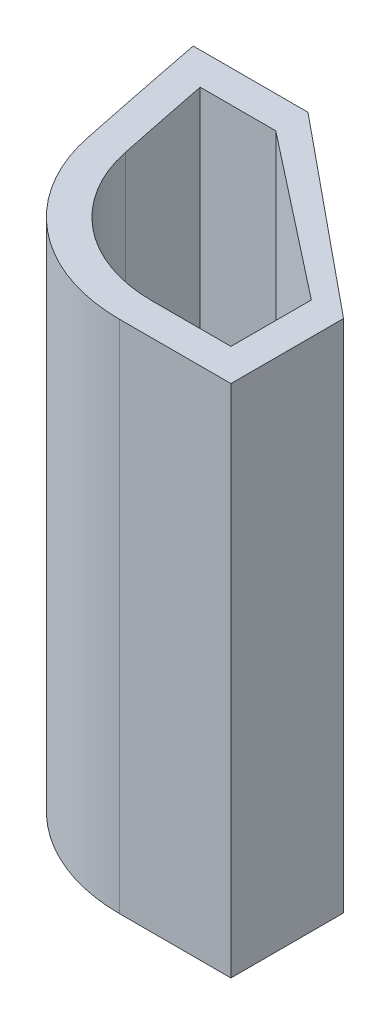
ISO-10303-21;
HEADER;
FILE_DESCRIPTION(('STEP AP214'),'2;1');
FILE_NAME('part.step','',(''),(''),'','','');
FILE_SCHEMA(('AUTOMOTIVE_DESIGN { 1 0 10303 214 1 1 1 1 }'));
ENDSEC;
DATA;
#1=APPLICATION_CONTEXT('core data for automotive mechanical design processes');
#2=APPLICATION_PROTOCOL_DEFINITION('international standard','automotive_design',2000,#1);
#3=PRODUCT_CONTEXT('',#1,'mechanical');
#4=PRODUCT('Part','Part','',(#3));
#5=PRODUCT_RELATED_PRODUCT_CATEGORY('part','',(#4));
#6=PRODUCT_DEFINITION_FORMATION('','',#4);
#7=PRODUCT_DEFINITION_CONTEXT('part definition',#1,'design');
#8=PRODUCT_DEFINITION('design','',#6,#7);
#9=PRODUCT_DEFINITION_SHAPE('','',#8);
#10=(LENGTH_UNIT() NAMED_UNIT(*) SI_UNIT(.MILLI.,.METRE.));
#11=(NAMED_UNIT(*) PLANE_ANGLE_UNIT() SI_UNIT($,.RADIAN.));
#12=(NAMED_UNIT(*) SI_UNIT($,.STERADIAN.) SOLID_ANGLE_UNIT());
#13=UNCERTAINTY_MEASURE_WITH_UNIT(LENGTH_MEASURE(1.E-05),#10,'distance_accuracy_value','');
#14=(GEOMETRIC_REPRESENTATION_CONTEXT(3) GLOBAL_UNCERTAINTY_ASSIGNED_CONTEXT((#13)) GLOBAL_UNIT_ASSIGNED_CONTEXT((#10,
#11,#12)) REPRESENTATION_CONTEXT('',''));
#15=CARTESIAN_POINT('',(0.,0.,0.));
#16=DIRECTION('',(0.,0.,1.));
#17=DIRECTION('',(1.,0.,0.));
#18=AXIS2_PLACEMENT_3D('',#15,#16,#17);
#19=CARTESIAN_POINT('',(0.919071585330417,16.,-1.40997917301637));
#20=DIRECTION('',(0.,1.,0.));
#21=DIRECTION('',(0.,0.,1.));
#22=AXIS2_PLACEMENT_3D('',#19,#20,#21);
#23=PLANE('',#22);
#24=DIRECTION('',(-0.773651844171533,0.,-0.633610940569988));
#25=VECTOR('',#24,1.);
#26=CARTESIAN_POINT('',(-1.72892998548849,16.,-4.40997917301636));
#27=LINE('',#26,#25);
#28=CARTESIAN_POINT('',(4.37617169943164,16.,0.590020826983631));
#29=VERTEX_POINT('',#28);
#30=CARTESIAN_POINT('',(-1.72892998548849,16.,-4.40997917301636));
#31=VERTEX_POINT('',#30);
#32=EDGE_CURVE('E202',#29,#31,#27,.T.);
#33=ORIENTED_EDGE('',*,*,#32,.T.);
#34=DIRECTION('',(-1.,0.,0.));
#35=VECTOR('',#34,1.);
#36=CARTESIAN_POINT('',(-1.72892998548849,16.,-4.40997917301636));
#37=LINE('',#36,#35);
#38=CARTESIAN_POINT('',(-5.29558734170321,16.,-4.40997917301635));
#39=VERTEX_POINT('',#38);
#40=EDGE_CURVE('E206',#31,#39,#37,.T.);
#41=ORIENTED_EDGE('',*,*,#40,.T.);
#42=CARTESIAN_POINT('',(330.516796699431,16.,-69.9099791730164));
#43=DIRECTION('',(0.,1.,0.));
#44=DIRECTION('',(0.,0.,1.));
#45=AXIS2_PLACEMENT_3D('',#42,#43,#44);
#46=CIRCLE('',#45,342.140625);
#47=CARTESIAN_POINT('',(-4.46586223876633,16.,-0.290833199472776));
#48=VERTEX_POINT('',#47);
#49=EDGE_CURVE('E210',#39,#48,#46,.T.);
#50=ORIENTED_EDGE('',*,*,#49,.T.);
#51=CARTESIAN_POINT('',(0.919071585330417,16.,-1.40997917301637));
#52=DIRECTION('',(0.,1.,0.));
#53=DIRECTION('',(0.,0.,1.));
#54=AXIS2_PLACEMENT_3D('',#51,#52,#53);
#55=CIRCLE('',#54,5.50000000000001);
#56=CARTESIAN_POINT('',(0.919071585330416,16.,4.09002082698364));
#57=VERTEX_POINT('',#56);
#58=EDGE_CURVE('E213',#48,#57,#55,.T.);
#59=ORIENTED_EDGE('',*,*,#58,.T.);
#60=DIRECTION('',(1.,0.,0.));
#61=VECTOR('',#60,1.);
#62=CARTESIAN_POINT('',(0.919071585330416,16.,4.09002082698364));
#63=LINE('',#62,#61);
#64=CARTESIAN_POINT('',(4.37617169943164,16.,4.09002082698364));
#65=VERTEX_POINT('',#64);
#66=EDGE_CURVE('E216',#57,#65,#63,.T.);
#67=ORIENTED_EDGE('',*,*,#66,.T.);
#68=DIRECTION('',(0.,0.,-1.));
#69=VECTOR('',#68,1.);
#70=CARTESIAN_POINT('',(4.37617169943164,16.,0.590020826983631));
#71=LINE('',#70,#69);
#72=EDGE_CURVE('E219',#65,#29,#71,.T.);
#73=ORIENTED_EDGE('',*,*,#72,.T.);
#74=EDGE_LOOP('',(#33,#41,#50,#59,#67,#73));
#75=FACE_BOUND('',#74,.T.);
#76=CARTESIAN_POINT('',(330.516796699431,16.,-69.9099791730164));
#77=DIRECTION('',(0.,1.,0.));
#78=DIRECTION('',(0.,0.,1.));
#79=AXIS2_PLACEMENT_3D('',#76,#77,#78);
#80=CIRCLE('',#79,341.140625);
#81=CARTESIAN_POINT('',(-4.07949142312153,16.,-3.40997917301628));
#82=VERTEX_POINT('',#81);
#83=CARTESIAN_POINT('',(-3.48678336165792,16.,-0.494314285571924));
#84=VERTEX_POINT('',#83);
#85=EDGE_CURVE('E140',#82,#84,#80,.T.);
#86=ORIENTED_EDGE('',*,*,#85,.F.);
#87=DIRECTION('',(-1.,0.,0.));
#88=VECTOR('',#87,1.);
#89=CARTESIAN_POINT('',(-1.72892998548849,16.,-3.40997917301636));
#90=LINE('',#89,#88);
#91=CARTESIAN_POINT('',(-1.72892998548849,16.,-3.40997917301636));
#92=VERTEX_POINT('',#91);
#93=EDGE_CURVE('E131',#92,#82,#90,.T.);
#94=ORIENTED_EDGE('',*,*,#93,.F.);
#95=DIRECTION('',(-0.787152920387147,0.,-0.616757877879144));
#96=VECTOR('',#95,1.);
#97=CARTESIAN_POINT('',(-1.72892998548849,16.,-3.40997917301636));
#98=LINE('',#97,#96);
#99=CARTESIAN_POINT('',(3.37617169943164,16.,0.59002082698363));
#100=VERTEX_POINT('',#99);
#101=EDGE_CURVE('E167',#100,#92,#98,.T.);
#102=ORIENTED_EDGE('',*,*,#101,.F.);
#103=DIRECTION('',(0.,0.,-1.));
#104=VECTOR('',#103,1.);
#105=CARTESIAN_POINT('',(3.37617169943164,16.,0.590020826983631));
#106=LINE('',#105,#104);
#107=CARTESIAN_POINT('',(3.37617169943164,16.,3.09002082698364));
#108=VERTEX_POINT('',#107);
#109=EDGE_CURVE('E164',#108,#100,#106,.T.);
#110=ORIENTED_EDGE('',*,*,#109,.F.);
#111=DIRECTION('',(1.,0.,0.));
#112=VECTOR('',#111,1.);
#113=CARTESIAN_POINT('',(0.919071585330416,16.,3.09002082698365));
#114=LINE('',#113,#112);
#115=CARTESIAN_POINT('',(0.919071585330416,16.,3.09002082698365));
#116=VERTEX_POINT('',#115);
#117=EDGE_CURVE('E158',#116,#108,#114,.T.);
#118=ORIENTED_EDGE('',*,*,#117,.F.);
#119=CARTESIAN_POINT('',(0.919071585330417,16.,-1.40997917301637));
#120=DIRECTION('',(0.,1.,0.));
#121=DIRECTION('',(0.,0.,1.));
#122=AXIS2_PLACEMENT_3D('',#119,#120,#121);
#123=CIRCLE('',#122,4.50000000000003);
#124=EDGE_CURVE('E154',#84,#116,#123,.T.);
#125=ORIENTED_EDGE('',*,*,#124,.F.);
#126=EDGE_LOOP('',(#86,#94,#102,#110,#118,#125));
#127=FACE_BOUND('',#126,.T.);
#128=ADVANCED_FACE('F41',(#75,#127),#23,.T.);
#129=CARTESIAN_POINT('',(0.919071585330417,0.,-1.40997917301637));
#130=DIRECTION('',(0.,1.,0.));
#131=DIRECTION('',(0.,0.,1.));
#132=AXIS2_PLACEMENT_3D('',#129,#130,#131);
#133=PLANE('',#132);
#134=DIRECTION('',(-0.773651844171533,0.,-0.633610940569988));
#135=VECTOR('',#134,1.);
#136=CARTESIAN_POINT('',(-1.72892998548849,0.,-4.40997917301636));
#137=LINE('',#136,#135);
#138=CARTESIAN_POINT('',(4.37617169943164,0.,0.590020826983631));
#139=VERTEX_POINT('',#138);
#140=CARTESIAN_POINT('',(-1.72892998548849,0.,-4.40997917301636));
#141=VERTEX_POINT('',#140);
#142=EDGE_CURVE('E149',#139,#141,#137,.T.);
#143=ORIENTED_EDGE('',*,*,#142,.F.);
#144=DIRECTION('',(0.,0.,-1.));
#145=VECTOR('',#144,1.);
#146=CARTESIAN_POINT('',(4.37617169943164,0.,0.590020826983631));
#147=LINE('',#146,#145);
#148=CARTESIAN_POINT('',(4.37617169943164,0.,4.09002082698364));
#149=VERTEX_POINT('',#148);
#150=EDGE_CURVE('E207',#149,#139,#147,.T.);
#151=ORIENTED_EDGE('',*,*,#150,.F.);
#152=DIRECTION('',(1.,0.,0.));
#153=VECTOR('',#152,1.);
#154=CARTESIAN_POINT('',(0.919071585330416,0.,4.09002082698364));
#155=LINE('',#154,#153);
#156=CARTESIAN_POINT('',(0.919071585330416,0.,4.09002082698364));
#157=VERTEX_POINT('',#156);
#158=EDGE_CURVE('E235',#157,#149,#155,.T.);
#159=ORIENTED_EDGE('',*,*,#158,.F.);
#160=CARTESIAN_POINT('',(0.919071585330417,0.,-1.40997917301637));
#161=DIRECTION('',(0.,1.,0.));
#162=DIRECTION('',(0.,0.,1.));
#163=AXIS2_PLACEMENT_3D('',#160,#161,#162);
#164=CIRCLE('',#163,5.50000000000001);
#165=CARTESIAN_POINT('',(-4.46586223876633,0.,-0.290833199472776));
#166=VERTEX_POINT('',#165);
#167=EDGE_CURVE('E232',#166,#157,#164,.T.);
#168=ORIENTED_EDGE('',*,*,#167,.F.);
#169=CARTESIAN_POINT('',(330.516796699431,0.,-69.9099791730164));
#170=DIRECTION('',(0.,1.,0.));
#171=DIRECTION('',(0.,0.,1.));
#172=AXIS2_PLACEMENT_3D('',#169,#170,#171);
#173=CIRCLE('',#172,342.140625);
#174=CARTESIAN_POINT('',(-5.29558734170321,0.,-4.40997917301635));
#175=VERTEX_POINT('',#174);
#176=EDGE_CURVE('E229',#175,#166,#173,.T.);
#177=ORIENTED_EDGE('',*,*,#176,.F.);
#178=DIRECTION('',(-1.,0.,0.));
#179=VECTOR('',#178,1.);
#180=CARTESIAN_POINT('',(-1.72892998548849,0.,-4.40997917301636));
#181=LINE('',#180,#179);
#182=EDGE_CURVE('E226',#141,#175,#181,.T.);
#183=ORIENTED_EDGE('',*,*,#182,.F.);
#184=EDGE_LOOP('',(#143,#151,#159,#168,#177,#183));
#185=FACE_BOUND('',#184,.T.);
#186=DIRECTION('',(-1.,0.,0.));
#187=VECTOR('',#186,1.);
#188=CARTESIAN_POINT('',(-1.72892998548849,0.,-3.40997917301636));
#189=LINE('',#188,#187);
#190=CARTESIAN_POINT('',(-1.72892998548849,0.,-3.40997917301636));
#191=VERTEX_POINT('',#190);
#192=CARTESIAN_POINT('',(-4.07949142312153,0.,-3.40997917301628));
#193=VERTEX_POINT('',#192);
#194=EDGE_CURVE('E65',#191,#193,#189,.T.);
#195=ORIENTED_EDGE('',*,*,#194,.T.);
#196=CARTESIAN_POINT('',(330.516796699431,0.,-69.9099791730164));
#197=DIRECTION('',(0.,1.,0.));
#198=DIRECTION('',(0.,0.,1.));
#199=AXIS2_PLACEMENT_3D('',#196,#197,#198);
#200=CIRCLE('',#199,341.140625);
#201=CARTESIAN_POINT('',(-3.48678336165792,0.,-0.494314285571924));
#202=VERTEX_POINT('',#201);
#203=EDGE_CURVE('E147',#193,#202,#200,.T.);
#204=ORIENTED_EDGE('',*,*,#203,.T.);
#205=CARTESIAN_POINT('',(0.919071585330417,0.,-1.40997917301637));
#206=DIRECTION('',(0.,1.,0.));
#207=DIRECTION('',(0.,0.,1.));
#208=AXIS2_PLACEMENT_3D('',#205,#206,#207);
#209=CIRCLE('',#208,4.50000000000003);
#210=CARTESIAN_POINT('',(0.919071585330416,0.,3.09002082698365));
#211=VERTEX_POINT('',#210);
#212=EDGE_CURVE('E175',#202,#211,#209,.T.);
#213=ORIENTED_EDGE('',*,*,#212,.T.);
#214=DIRECTION('',(1.,0.,0.));
#215=VECTOR('',#214,1.);
#216=CARTESIAN_POINT('',(0.919071585330416,0.,3.09002082698365));
#217=LINE('',#216,#215);
#218=CARTESIAN_POINT('',(3.37617169943164,0.,3.09002082698364));
#219=VERTEX_POINT('',#218);
#220=EDGE_CURVE('E179',#211,#219,#217,.T.);
#221=ORIENTED_EDGE('',*,*,#220,.T.);
#222=DIRECTION('',(0.,0.,-1.));
#223=VECTOR('',#222,1.);
#224=CARTESIAN_POINT('',(3.37617169943164,0.,0.590020826983631));
#225=LINE('',#224,#223);
#226=CARTESIAN_POINT('',(3.37617169943164,0.,0.590020826983631));
#227=VERTEX_POINT('',#226);
#228=EDGE_CURVE('E183',#219,#227,#225,.T.);
#229=ORIENTED_EDGE('',*,*,#228,.T.);
#230=DIRECTION('',(-0.787152920387147,0.,-0.616757877879144));
#231=VECTOR('',#230,1.);
#232=CARTESIAN_POINT('',(-1.72892998548849,0.,-3.40997917301636));
#233=LINE('',#232,#231);
#234=EDGE_CURVE('E141',#227,#191,#233,.T.);
#235=ORIENTED_EDGE('',*,*,#234,.T.);
#236=EDGE_LOOP('',(#195,#204,#213,#221,#229,#235));
#237=FACE_BOUND('',#236,.T.);
#238=ADVANCED_FACE('F266',(#185,#237),#133,.F.);
#239=CARTESIAN_POINT('',(-1.72892998548849,16.,-4.40997917301636));
#240=DIRECTION('',(-0.633610940569989,0.,0.773651844171534));
#241=DIRECTION('',(0.773651844171533,0.,0.633610940569988));
#242=AXIS2_PLACEMENT_3D('',#239,#240,#241);
#243=PLANE('',#242);
#244=CARTESIAN_POINT('',(1.39563313782047,8.,-1.85100203834655));
#245=DIRECTION('',(0.633610940569988,0.,-0.773651844171533));
#246=DIRECTION('',(-0.773651844171533,0.,-0.633610940569988));
#247=AXIS2_PLACEMENT_3D('',#244,#245,#246);
#248=CIRCLE('',#247,1.6);
#249=CARTESIAN_POINT('',(0.157790187146014,8.,-2.86477954325853));
#250=VERTEX_POINT('',#249);
#251=EDGE_CURVE('E328',#250,#250,#248,.T.);
#252=ORIENTED_EDGE('',*,*,#251,.F.);
#253=EDGE_LOOP('',(#252));
#254=FACE_BOUND('',#253,.T.);
#255=ORIENTED_EDGE('',*,*,#142,.T.);
#256=DIRECTION('',(0.,-1.,0.));
#257=VECTOR('',#256,1.);
#258=CARTESIAN_POINT('',(-1.72892998548849,16.,-4.40997917301636));
#259=LINE('',#258,#257);
#260=EDGE_CURVE('E11',#31,#141,#259,.T.);
#261=ORIENTED_EDGE('',*,*,#260,.F.);
#262=ORIENTED_EDGE('',*,*,#32,.F.);
#263=DIRECTION('',(0.,-1.,0.));
#264=VECTOR('',#263,1.);
#265=CARTESIAN_POINT('',(4.37617169943164,16.,0.590020826983631));
#266=LINE('',#265,#264);
#267=EDGE_CURVE('E222',#29,#139,#266,.T.);
#268=ORIENTED_EDGE('',*,*,#267,.T.);
#269=EDGE_LOOP('',(#255,#261,#262,#268));
#270=FACE_BOUND('',#269,.T.);
#271=ADVANCED_FACE('F43',(#254,#270),#243,.F.);
#272=CARTESIAN_POINT('',(-1.72892998548849,16.,-4.40997917301636));
#273=DIRECTION('',(0.,0.,1.));
#274=DIRECTION('',(1.,0.,0.));
#275=AXIS2_PLACEMENT_3D('',#272,#273,#274);
#276=PLANE('',#275);
#277=ORIENTED_EDGE('',*,*,#182,.T.);
#278=DIRECTION('',(0.,-1.,0.));
#279=VECTOR('',#278,1.);
#280=CARTESIAN_POINT('',(-5.29558734170321,16.,-4.40997917301635));
#281=LINE('',#280,#279);
#282=EDGE_CURVE('E50',#39,#175,#281,.T.);
#283=ORIENTED_EDGE('',*,*,#282,.F.);
#284=ORIENTED_EDGE('',*,*,#40,.F.);
#285=ORIENTED_EDGE('',*,*,#260,.T.);
#286=EDGE_LOOP('',(#277,#283,#284,#285));
#287=FACE_BOUND('',#286,.T.);
#288=ADVANCED_FACE('F283',(#287),#276,.F.);
#289=CARTESIAN_POINT('',(330.516796699431,16.,-69.9099791730164));
#290=DIRECTION('',(0.,-1.,0.));
#291=DIRECTION('',(0.,0.,-1.));
#292=AXIS2_PLACEMENT_3D('',#289,#290,#291);
#293=CYLINDRICAL_SURFACE('',#292,342.140625);
#294=ORIENTED_EDGE('',*,*,#176,.T.);
#295=DIRECTION('',(0.,-1.,0.));
#296=VECTOR('',#295,1.);
#297=CARTESIAN_POINT('',(-4.46586223876633,16.,-0.290833199472776));
#298=LINE('',#297,#296);
#299=EDGE_CURVE('E251',#48,#166,#298,.T.);
#300=ORIENTED_EDGE('',*,*,#299,.F.);
#301=ORIENTED_EDGE('',*,*,#49,.F.);
#302=ORIENTED_EDGE('',*,*,#282,.T.);
#303=EDGE_LOOP('',(#294,#300,#301,#302));
#304=FACE_BOUND('',#303,.T.);
#305=ADVANCED_FACE('F260',(#304),#293,.T.);
#306=CARTESIAN_POINT('',(0.919071585330417,16.,-1.40997917301637));
#307=DIRECTION('',(0.,-1.,0.));
#308=DIRECTION('',(0.,0.,-1.));
#309=AXIS2_PLACEMENT_3D('',#306,#307,#308);
#310=CYLINDRICAL_SURFACE('',#309,5.50000000000001);
#311=ORIENTED_EDGE('',*,*,#167,.T.);
#312=DIRECTION('',(0.,-1.,0.));
#313=VECTOR('',#312,1.);
#314=CARTESIAN_POINT('',(0.919071585330416,16.,4.09002082698364));
#315=LINE('',#314,#313);
#316=EDGE_CURVE('E247',#57,#157,#315,.T.);
#317=ORIENTED_EDGE('',*,*,#316,.F.);
#318=ORIENTED_EDGE('',*,*,#58,.F.);
#319=ORIENTED_EDGE('',*,*,#299,.T.);
#320=EDGE_LOOP('',(#311,#317,#318,#319));
#321=FACE_BOUND('',#320,.T.);
#322=ADVANCED_FACE('F272',(#321),#310,.T.);
#323=CARTESIAN_POINT('',(0.919071585330416,16.,4.09002082698364));
#324=DIRECTION('',(0.,0.,-1.));
#325=DIRECTION('',(-1.,0.,0.));
#326=AXIS2_PLACEMENT_3D('',#323,#324,#325);
#327=PLANE('',#326);
#328=ORIENTED_EDGE('',*,*,#158,.T.);
#329=DIRECTION('',(0.,-1.,0.));
#330=VECTOR('',#329,1.);
#331=CARTESIAN_POINT('',(4.37617169943164,16.,4.09002082698364));
#332=LINE('',#331,#330);
#333=EDGE_CURVE('E243',#65,#149,#332,.T.);
#334=ORIENTED_EDGE('',*,*,#333,.F.);
#335=ORIENTED_EDGE('',*,*,#66,.F.);
#336=ORIENTED_EDGE('',*,*,#316,.T.);
#337=EDGE_LOOP('',(#328,#334,#335,#336));
#338=FACE_BOUND('',#337,.T.);
#339=ADVANCED_FACE('F276',(#338),#327,.F.);
#340=CARTESIAN_POINT('',(4.37617169943164,16.,0.590020826983631));
#341=DIRECTION('',(-1.,0.,0.));
#342=DIRECTION('',(0.,0.,1.));
#343=AXIS2_PLACEMENT_3D('',#340,#341,#342);
#344=PLANE('',#343);
#345=ORIENTED_EDGE('',*,*,#150,.T.);
#346=ORIENTED_EDGE('',*,*,#267,.F.);
#347=ORIENTED_EDGE('',*,*,#72,.F.);
#348=ORIENTED_EDGE('',*,*,#333,.T.);
#349=EDGE_LOOP('',(#345,#346,#347,#348));
#350=FACE_BOUND('',#349,.T.);
#351=ADVANCED_FACE('F286',(#350),#344,.F.);
#352=CARTESIAN_POINT('',(-1.72892998548849,16.,-3.40997917301636));
#353=DIRECTION('',(0.,0.,1.));
#354=DIRECTION('',(1.,0.,0.));
#355=AXIS2_PLACEMENT_3D('',#352,#353,#354);
#356=PLANE('',#355);
#357=ORIENTED_EDGE('',*,*,#194,.F.);
#358=DIRECTION('',(0.,-1.,0.));
#359=VECTOR('',#358,1.);
#360=CARTESIAN_POINT('',(-1.72892998548849,16.,-3.40997917301636));
#361=LINE('',#360,#359);
#362=EDGE_CURVE('E135',#92,#191,#361,.T.);
#363=ORIENTED_EDGE('',*,*,#362,.F.);
#364=ORIENTED_EDGE('',*,*,#93,.T.);
#365=DIRECTION('',(0.,-1.,0.));
#366=VECTOR('',#365,1.);
#367=CARTESIAN_POINT('',(-4.07949142312153,16.,-3.40997917301628));
#368=LINE('',#367,#366);
#369=EDGE_CURVE('E134',#82,#193,#368,.T.);
#370=ORIENTED_EDGE('',*,*,#369,.T.);
#371=EDGE_LOOP('',(#357,#363,#364,#370));
#372=FACE_BOUND('',#371,.T.);
#373=ADVANCED_FACE('F133',(#372),#356,.T.);
#374=CARTESIAN_POINT('',(330.516796699431,16.,-69.9099791730164));
#375=DIRECTION('',(0.,-1.,0.));
#376=DIRECTION('',(0.,0.,-1.));
#377=AXIS2_PLACEMENT_3D('',#374,#375,#376);
#378=CYLINDRICAL_SURFACE('',#377,341.140625);
#379=ORIENTED_EDGE('',*,*,#203,.F.);
#380=ORIENTED_EDGE('',*,*,#369,.F.);
#381=ORIENTED_EDGE('',*,*,#85,.T.);
#382=DIRECTION('',(0.,-1.,0.));
#383=VECTOR('',#382,1.);
#384=CARTESIAN_POINT('',(-3.48678336165792,16.,-0.494314285571924));
#385=LINE('',#384,#383);
#386=EDGE_CURVE('E150',#84,#202,#385,.T.);
#387=ORIENTED_EDGE('',*,*,#386,.T.);
#388=EDGE_LOOP('',(#379,#380,#381,#387));
#389=FACE_BOUND('',#388,.T.);
#390=ADVANCED_FACE('F144',(#389),#378,.F.);
#391=CARTESIAN_POINT('',(0.919071585330417,16.,-1.40997917301637));
#392=DIRECTION('',(0.,-1.,0.));
#393=DIRECTION('',(0.,0.,-1.));
#394=AXIS2_PLACEMENT_3D('',#391,#392,#393);
#395=CYLINDRICAL_SURFACE('',#394,4.50000000000003);
#396=ORIENTED_EDGE('',*,*,#212,.F.);
#397=ORIENTED_EDGE('',*,*,#386,.F.);
#398=ORIENTED_EDGE('',*,*,#124,.T.);
#399=DIRECTION('',(0.,-1.,0.));
#400=VECTOR('',#399,1.);
#401=CARTESIAN_POINT('',(0.919071585330416,16.,3.09002082698365));
#402=LINE('',#401,#400);
#403=EDGE_CURVE('E197',#116,#211,#402,.T.);
#404=ORIENTED_EDGE('',*,*,#403,.T.);
#405=EDGE_LOOP('',(#396,#397,#398,#404));
#406=FACE_BOUND('',#405,.T.);
#407=ADVANCED_FACE('F304',(#406),#395,.F.);
#408=CARTESIAN_POINT('',(0.919071585330416,16.,3.09002082698365));
#409=DIRECTION('',(0.,0.,-1.));
#410=DIRECTION('',(-1.,0.,0.));
#411=AXIS2_PLACEMENT_3D('',#408,#409,#410);
#412=PLANE('',#411);
#413=ORIENTED_EDGE('',*,*,#220,.F.);
#414=ORIENTED_EDGE('',*,*,#403,.F.);
#415=ORIENTED_EDGE('',*,*,#117,.T.);
#416=DIRECTION('',(0.,-1.,0.));
#417=VECTOR('',#416,1.);
#418=CARTESIAN_POINT('',(3.37617169943164,16.,3.09002082698364));
#419=LINE('',#418,#417);
#420=EDGE_CURVE('E194',#108,#219,#419,.T.);
#421=ORIENTED_EDGE('',*,*,#420,.T.);
#422=EDGE_LOOP('',(#413,#414,#415,#421));
#423=FACE_BOUND('',#422,.T.);
#424=ADVANCED_FACE('F307',(#423),#412,.T.);
#425=CARTESIAN_POINT('',(3.37617169943164,16.,0.590020826983631));
#426=DIRECTION('',(-1.,0.,0.));
#427=DIRECTION('',(0.,0.,1.));
#428=AXIS2_PLACEMENT_3D('',#425,#426,#427);
#429=PLANE('',#428);
#430=ORIENTED_EDGE('',*,*,#228,.F.);
#431=ORIENTED_EDGE('',*,*,#420,.F.);
#432=ORIENTED_EDGE('',*,*,#109,.T.);
#433=DIRECTION('',(0.,-1.,0.));
#434=VECTOR('',#433,1.);
#435=CARTESIAN_POINT('',(3.37617169943164,16.,0.590020826983631));
#436=LINE('',#435,#434);
#437=EDGE_CURVE('E57',#100,#227,#436,.T.);
#438=ORIENTED_EDGE('',*,*,#437,.T.);
#439=EDGE_LOOP('',(#430,#431,#432,#438));
#440=FACE_BOUND('',#439,.T.);
#441=ADVANCED_FACE('F311',(#440),#429,.T.);
#442=CARTESIAN_POINT('',(-1.72892998548849,16.,-3.40997917301636));
#443=DIRECTION('',(-0.616757877879145,0.,0.787152920387147));
#444=DIRECTION('',(0.787152920387147,0.,0.616757877879145));
#445=AXIS2_PLACEMENT_3D('',#442,#443,#444);
#446=PLANE('',#445);
#447=CARTESIAN_POINT('',(0.952036574936417,8.,-1.30936161364891));
#448=DIRECTION('',(-0.616757877879145,0.,0.787152920387147));
#449=DIRECTION('',(0.787152920387147,0.,0.616757877879145));
#450=AXIS2_PLACEMENT_3D('',#447,#448,#449);
#451=ELLIPSE('',#450,1.60037313082118,1.6);
#452=CARTESIAN_POINT('',(2.21177495857143,8.,-0.322318877668834));
#453=VERTEX_POINT('',#452);
#454=EDGE_CURVE('E172',#453,#453,#451,.F.);
#455=ORIENTED_EDGE('',*,*,#454,.T.);
#456=EDGE_LOOP('',(#455));
#457=FACE_BOUND('',#456,.T.);
#458=ORIENTED_EDGE('',*,*,#234,.F.);
#459=ORIENTED_EDGE('',*,*,#437,.F.);
#460=ORIENTED_EDGE('',*,*,#101,.T.);
#461=ORIENTED_EDGE('',*,*,#362,.T.);
#462=EDGE_LOOP('',(#458,#459,#460,#461));
#463=FACE_BOUND('',#462,.T.);
#464=ADVANCED_FACE('F315',(#457,#463),#446,.T.);
#465=CARTESIAN_POINT('',(-1.91569356646009,8.,2.1921952099783));
#466=DIRECTION('',(0.633610940569988,0.,-0.773651844171533));
#467=DIRECTION('',(-0.773651844171534,0.,-0.633610940569989));
#468=AXIS2_PLACEMENT_3D('',#465,#466,#467);
#469=CYLINDRICAL_SURFACE('',#468,1.6);
#470=ORIENTED_EDGE('',*,*,#251,.T.);
#471=EDGE_LOOP('',(#470));
#472=FACE_BOUND('',#471,.T.);
#473=ORIENTED_EDGE('',*,*,#454,.F.);
#474=EDGE_LOOP('',(#473));
#475=FACE_BOUND('',#474,.T.);
#476=ADVANCED_FACE('F319',(#472,#475),#469,.F.);
#477=CLOSED_SHELL('',(#128,#238,#271,#288,#305,#322,#339,#351,#373,#390,#407,#424,#441,#464,#476));
#478=MANIFOLD_SOLID_BREP('B2',#477);
#479=ADVANCED_BREP_SHAPE_REPRESENTATION('',(#18,#478),#14);
#480=SHAPE_DEFINITION_REPRESENTATION(#9,#479);
ENDSEC;
END-ISO-10303-21;
